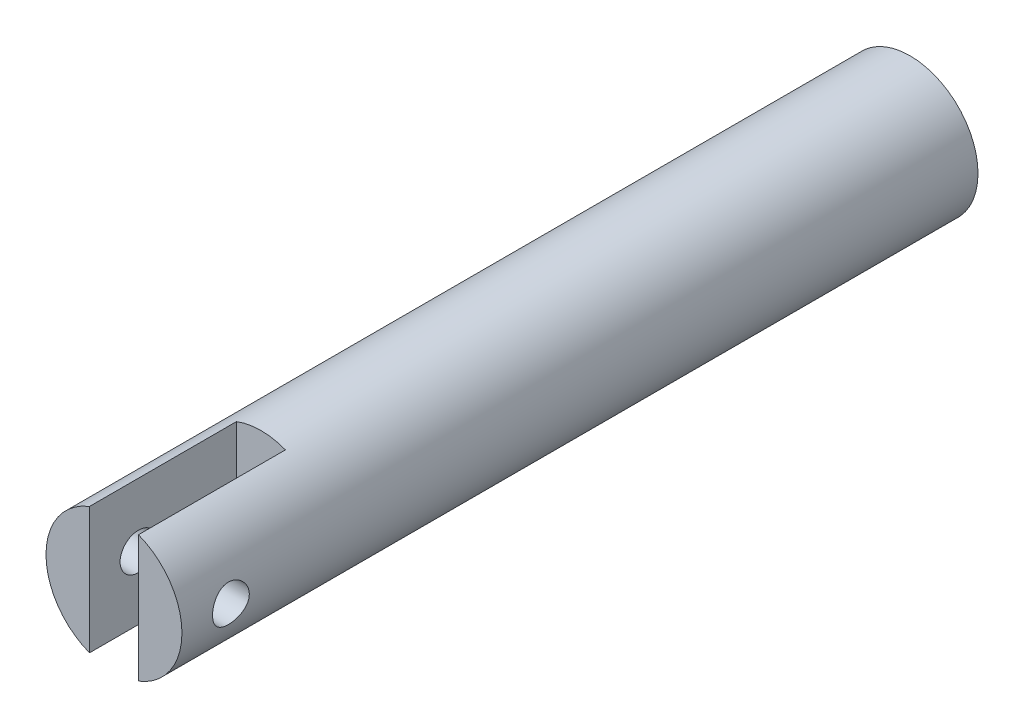
ISO-10303-21;
HEADER;
FILE_DESCRIPTION(('STEP AP214'),'2;1');
FILE_NAME('part.step','',(''),(''),'','','');
FILE_SCHEMA(('AUTOMOTIVE_DESIGN { 1 0 10303 214 1 1 1 1 }'));
ENDSEC;
DATA;
#1=APPLICATION_CONTEXT('core data for automotive mechanical design processes');
#2=APPLICATION_PROTOCOL_DEFINITION('international standard','automotive_design',2000,#1);
#3=PRODUCT_CONTEXT('',#1,'mechanical');
#4=PRODUCT('Part','Part','',(#3));
#5=PRODUCT_RELATED_PRODUCT_CATEGORY('part','',(#4));
#6=PRODUCT_DEFINITION_FORMATION('','',#4);
#7=PRODUCT_DEFINITION_CONTEXT('part definition',#1,'design');
#8=PRODUCT_DEFINITION('design','',#6,#7);
#9=PRODUCT_DEFINITION_SHAPE('','',#8);
#10=(LENGTH_UNIT() NAMED_UNIT(*) SI_UNIT(.MILLI.,.METRE.));
#11=(NAMED_UNIT(*) PLANE_ANGLE_UNIT() SI_UNIT($,.RADIAN.));
#12=(NAMED_UNIT(*) SI_UNIT($,.STERADIAN.) SOLID_ANGLE_UNIT());
#13=UNCERTAINTY_MEASURE_WITH_UNIT(LENGTH_MEASURE(1.E-05),#10,'distance_accuracy_value','');
#14=(GEOMETRIC_REPRESENTATION_CONTEXT(3) GLOBAL_UNCERTAINTY_ASSIGNED_CONTEXT((#13)) GLOBAL_UNIT_ASSIGNED_CONTEXT((#10,
#11,#12)) REPRESENTATION_CONTEXT('',''));
#15=CARTESIAN_POINT('',(0.,0.,0.));
#16=DIRECTION('',(0.,0.,1.));
#17=DIRECTION('',(1.,0.,0.));
#18=AXIS2_PLACEMENT_3D('',#15,#16,#17);
#19=CARTESIAN_POINT('',(0.,0.,65.));
#20=DIRECTION('',(0.,0.,1.));
#21=DIRECTION('',(1.,0.,0.));
#22=AXIS2_PLACEMENT_3D('',#19,#20,#21);
#23=PLANE('',#22);
#24=DIRECTION('',(0.,-1.,0.));
#25=VECTOR('',#24,1.);
#26=CARTESIAN_POINT('',(-2.,5.17711309515255,65.));
#27=LINE('',#26,#25);
#28=CARTESIAN_POINT('',(-2.,5.17711309515255,65.));
#29=VERTEX_POINT('',#28);
#30=CARTESIAN_POINT('',(-2.,-5.17711309515255,65.));
#31=VERTEX_POINT('',#30);
#32=EDGE_CURVE('E74',#29,#31,#27,.T.);
#33=ORIENTED_EDGE('',*,*,#32,.F.);
#34=CARTESIAN_POINT('',(0.,0.,65.));
#35=DIRECTION('',(0.,0.,1.));
#36=DIRECTION('',(1.,0.,0.));
#37=AXIS2_PLACEMENT_3D('',#34,#35,#36);
#38=CIRCLE('',#37,5.55);
#39=EDGE_CURVE('E11',#29,#31,#38,.T.);
#40=ORIENTED_EDGE('',*,*,#39,.T.);
#41=EDGE_LOOP('',(#33,#40));
#42=FACE_BOUND('',#41,.T.);
#43=ADVANCED_FACE('F33',(#42),#23,.T.);
#44=CARTESIAN_POINT('',(0.,0.,65.));
#45=DIRECTION('',(0.,0.,-1.));
#46=DIRECTION('',(-1.,0.,0.));
#47=AXIS2_PLACEMENT_3D('',#44,#45,#46);
#48=CYLINDRICAL_SURFACE('',#47,5.55);
#49=CARTESIAN_POINT('',(-5.55,0.,59.5));
#50=CARTESIAN_POINT('',(-5.54999879615194,0.0826494633927154,59.5000018746962));
#51=CARTESIAN_POINT('',(-5.54813568532362,0.165318848419868,59.506853812904));
#52=CARTESIAN_POINT('',(-5.54088440898738,0.328273451632411,59.5340303315248));
#53=CARTESIAN_POINT('',(-5.53549461428784,0.408557549979276,59.5543611387117));
#54=CARTESIAN_POINT('',(-5.52178442124985,0.564366049193908,59.6077840939381));
#55=CARTESIAN_POINT('',(-5.51346785987332,0.639896529910036,59.6408595392463));
#56=CARTESIAN_POINT('',(-5.49478153503013,0.784338444058895,59.7187702709216));
#57=CARTESIAN_POINT('',(-5.48441162002809,0.85324938841894,59.7636064252962));
#58=CARTESIAN_POINT('',(-5.46246127093075,0.984133559937081,59.8648904757167));
#59=CARTESIAN_POINT('',(-5.45085970647635,1.04592709324454,59.9215660045104));
#60=CARTESIAN_POINT('',(-5.42788828388297,1.15925819722945,60.0444335444044));
#61=CARTESIAN_POINT('',(-5.41651845661983,1.21079440917286,60.1106268142728));
#62=CARTESIAN_POINT('',(-5.39508096210617,1.30303115342026,60.2520939917978));
#63=CARTESIAN_POINT('',(-5.38503991518082,1.34352367385294,60.3275079287304));
#64=CARTESIAN_POINT('',(-5.36770808081144,1.41118330571831,60.4843887684982));
#65=CARTESIAN_POINT('',(-5.36041677093315,1.43835294871614,60.5658545179994));
#66=CARTESIAN_POINT('',(-5.34962833164668,1.47796903905552,60.7305333611906));
#67=CARTESIAN_POINT('',(-5.34604724875154,1.49074186800391,60.8136623033563));
#68=CARTESIAN_POINT('',(-5.34283400169016,1.50221948422755,60.9809542865722));
#69=CARTESIAN_POINT('',(-5.34320107787369,1.50092697775977,61.0651171255816));
#70=CARTESIAN_POINT('',(-5.34776761089798,1.48456944039451,61.2295297086572));
#71=CARTESIAN_POINT('',(-5.35185678021551,1.46990073062952,61.3098224354498));
#72=CARTESIAN_POINT('',(-5.36322997341351,1.42784250780183,61.4667624758096));
#73=CARTESIAN_POINT('',(-5.37051425881699,1.40045195343429,61.5434094904027));
#74=CARTESIAN_POINT('',(-5.38755296870838,1.3334078704218,61.6919088355209));
#75=CARTESIAN_POINT('',(-5.39733492625185,1.29361648626527,61.7636956347143));
#76=CARTESIAN_POINT('',(-5.41825216289466,1.20299640255253,61.8997117370747));
#77=CARTESIAN_POINT('',(-5.429387714712,1.1521654771554,61.9639395121253));
#78=CARTESIAN_POINT('',(-5.45221531507438,1.03888875462571,62.0852771073868));
#79=CARTESIAN_POINT('',(-5.46391350077369,0.976110532435758,62.1420758788547));
#80=CARTESIAN_POINT('',(-5.48621371709655,0.841776678813462,62.2444039738118));
#81=CARTESIAN_POINT('',(-5.49681570215022,0.770220682752514,62.2899328289116));
#82=CARTESIAN_POINT('',(-5.51579714245651,0.619872258080171,62.3685708376427));
#83=CARTESIAN_POINT('',(-5.5241662411197,0.541048315268525,62.4016224029782));
#84=CARTESIAN_POINT('',(-5.53766413798729,0.37868461864081,62.4539145573887));
#85=CARTESIAN_POINT('',(-5.54279366413402,0.295145928842746,62.4731582492697));
#86=CARTESIAN_POINT('',(-5.54912384681125,0.128377573772656,62.4967970008638));
#87=CARTESIAN_POINT('',(-5.5504363277452,0.0452119855218677,62.5016148108581));
#88=CARTESIAN_POINT('',(-5.54930671534324,-0.120739317200337,62.4974343088602));
#89=CARTESIAN_POINT('',(-5.54686502145572,-0.203525071146549,62.4884374667625));
#90=CARTESIAN_POINT('',(-5.53857375333191,-0.364848942531915,62.4572293591669));
#91=CARTESIAN_POINT('',(-5.53278532499192,-0.443436330325438,62.435255045592));
#92=CARTESIAN_POINT('',(-5.51845832017505,-0.595800840535774,62.378991941288));
#93=CARTESIAN_POINT('',(-5.50991944162924,-0.669577433535165,62.3447017979219));
#94=CARTESIAN_POINT('',(-5.49077807060945,-0.811859862642032,62.2640040455767));
#95=CARTESIAN_POINT('',(-5.48013775012766,-0.880230910060631,62.2173679825496));
#96=CARTESIAN_POINT('',(-5.45802286326308,-1.00832472838278,62.1135883880366));
#97=CARTESIAN_POINT('',(-5.44654812774349,-1.06804573853389,62.0564427226339));
#98=CARTESIAN_POINT('',(-5.42364433808291,-1.17893417351261,61.9312913887765));
#99=CARTESIAN_POINT('',(-5.41222627781712,-1.22980300036862,61.8630186397425));
#100=CARTESIAN_POINT('',(-5.39109349586186,-1.31936978116537,61.7186634174368));
#101=CARTESIAN_POINT('',(-5.38137870475979,-1.35806823113139,61.6425812626188));
#102=CARTESIAN_POINT('',(-5.3648647316121,-1.42190514266968,61.4851369239655));
#103=CARTESIAN_POINT('',(-5.35804890811988,-1.44712122035433,61.4038080506478));
#104=CARTESIAN_POINT('',(-5.34810458208024,-1.48345508406507,61.2378480302932));
#105=CARTESIAN_POINT('',(-5.34497510580962,-1.49457659313316,61.1532177614018));
#106=CARTESIAN_POINT('',(-5.34284070068284,-1.50218723372163,60.9861187129008));
#107=CARTESIAN_POINT('',(-5.3437003024775,-1.49915693877548,60.9036732285872));
#108=CARTESIAN_POINT('',(-5.34912914015623,-1.47966808775349,60.7405157803563));
#109=CARTESIAN_POINT('',(-5.35369827560105,-1.463209895251,60.6598037695642));
#110=CARTESIAN_POINT('',(-5.36594961229916,-1.4176145187469,60.5030277270834));
#111=CARTESIAN_POINT('',(-5.37360613355019,-1.38858178212087,60.426931170208));
#112=CARTESIAN_POINT('',(-5.39116955463475,-1.3187424295426,60.2806309729558));
#113=CARTESIAN_POINT('',(-5.40107681611949,-1.27793392116245,60.2104282820968));
#114=CARTESIAN_POINT('',(-5.42239869846201,-1.18425604648313,60.0756211641228));
#115=CARTESIAN_POINT('',(-5.43384977433815,-1.13105999285312,60.0112494924036));
#116=CARTESIAN_POINT('',(-5.45676839722498,-1.01473492702236,59.8921904291386));
#117=CARTESIAN_POINT('',(-5.46823594757932,-0.951603488480783,59.8375054101423));
#118=CARTESIAN_POINT('',(-5.49019935014915,-0.815512191776865,59.7381791110337));
#119=CARTESIAN_POINT('',(-5.5006680449896,-0.742365569701441,59.6937871970298));
#120=CARTESIAN_POINT('',(-5.51915451258881,-0.589366695549458,59.6179997935478));
#121=CARTESIAN_POINT('',(-5.52717381491222,-0.509518668160427,59.5865961889431));
#122=CARTESIAN_POINT('',(-5.53885482984226,-0.358337261031642,59.5416438492013));
#123=CARTESIAN_POINT('',(-5.54300340741267,-0.287638783374459,59.5260642669616));
#124=CARTESIAN_POINT('',(-5.54857637665883,-0.144631842519288,59.5052420630478));
#125=CARTESIAN_POINT('',(-5.55000105344379,-0.0723235486214627,59.4999983595213));
#126=CARTESIAN_POINT('',(-5.55,0.,59.5));
#127=B_SPLINE_CURVE_WITH_KNOTS('',3,(#49,#50,#51,#52,#53,#54,#55,#56,#57,#58,#59,#60,#61,#62,
#63,#64,#65,#66,#67,#68,#69,#70,#71,#72,#73,#74,#75,#76,#77,#78,#79,#80,#81,#82,#83,#84,#85,#86,
#87,#88,#89,#90,#91,#92,#93,#94,#95,#96,#97,#98,#99,#100,#101,#102,#103,#104,#105,#106,#107,
#108,#109,#110,#111,#112,#113,#114,#115,#116,#117,#118,#119,#120,#121,#122,#123,#124,#125,#126),
.UNSPECIFIED.,.T.,.F.,(4,2,2,2,2,2,2,2,2,2,2,2,2,2,2,2,2,2,2,2,2,2,2,2,2,2,2,2,2,2,2,2,2,2,2,2,
2,2,4),(0.,0.247683117479802,0.495480735843709,0.742954696811896,0.990446927913596,
1.24322718642299,1.49604090716615,1.75333091968523,2.01057202392053,2.26185607755089,
2.51309178343998,2.75711729570227,3.0011627853929,3.24802431731499,3.49493566883073,
3.75012973834969,4.00533441221877,4.26170297346541,4.51801390735887,4.76673633023641,
5.01543229060086,5.25972195861126,5.50403846495144,5.75323722720833,6.00248664387578,
6.25897090131834,6.51544470393504,6.77042567663096,7.02533928274809,7.27166059273816,
7.51797523356144,7.76228202195334,8.0066280936063,8.2583449745939,8.51012342354435,
8.76748013023476,9.02467579604023,9.24143700090325,9.45817551624786),.UNSPECIFIED.);
#128=CARTESIAN_POINT('',(-5.55,0.,59.5));
#129=VERTEX_POINT('',#128);
#130=EDGE_CURVE('E105',#129,#129,#127,.T.);
#131=ORIENTED_EDGE('',*,*,#130,.T.);
#132=EDGE_LOOP('',(#131));
#133=FACE_BOUND('',#132,.T.);
#134=CARTESIAN_POINT('',(5.55,0.,59.5));
#135=CARTESIAN_POINT('',(5.54999879615194,-0.0826494633927154,59.5000018746962));
#136=CARTESIAN_POINT('',(5.54813568532362,-0.165318848419868,59.506853812904));
#137=CARTESIAN_POINT('',(5.54088440898738,-0.328273451632411,59.5340303315248));
#138=CARTESIAN_POINT('',(5.53549461428784,-0.408557549979276,59.5543611387117));
#139=CARTESIAN_POINT('',(5.52178442124985,-0.564366049193908,59.6077840939381));
#140=CARTESIAN_POINT('',(5.51346785987332,-0.639896529910036,59.6408595392463));
#141=CARTESIAN_POINT('',(5.49478153503013,-0.784338444058895,59.7187702709216));
#142=CARTESIAN_POINT('',(5.48441162002809,-0.85324938841894,59.7636064252962));
#143=CARTESIAN_POINT('',(5.46246127093075,-0.984133559937081,59.8648904757167));
#144=CARTESIAN_POINT('',(5.45085970647635,-1.04592709324454,59.9215660045104));
#145=CARTESIAN_POINT('',(5.42788828388297,-1.15925819722945,60.0444335444044));
#146=CARTESIAN_POINT('',(5.41651845661983,-1.21079440917286,60.1106268142728));
#147=CARTESIAN_POINT('',(5.39508096210617,-1.30303115342026,60.2520939917978));
#148=CARTESIAN_POINT('',(5.38503991518082,-1.34352367385294,60.3275079287304));
#149=CARTESIAN_POINT('',(5.36770808081144,-1.41118330571831,60.4843887684982));
#150=CARTESIAN_POINT('',(5.36041677093315,-1.43835294871614,60.5658545179994));
#151=CARTESIAN_POINT('',(5.34962833164668,-1.47796903905552,60.7305333611906));
#152=CARTESIAN_POINT('',(5.34604724875154,-1.49074186800391,60.8136623033563));
#153=CARTESIAN_POINT('',(5.34283400169016,-1.50221948422755,60.9809542865722));
#154=CARTESIAN_POINT('',(5.34320107787369,-1.50092697775977,61.0651171255816));
#155=CARTESIAN_POINT('',(5.34776761089798,-1.48456944039451,61.2295297086572));
#156=CARTESIAN_POINT('',(5.35185678021551,-1.46990073062952,61.3098224354498));
#157=CARTESIAN_POINT('',(5.36322997341351,-1.42784250780183,61.4667624758096));
#158=CARTESIAN_POINT('',(5.37051425881699,-1.40045195343429,61.5434094904027));
#159=CARTESIAN_POINT('',(5.38755296870838,-1.3334078704218,61.6919088355209));
#160=CARTESIAN_POINT('',(5.39733492625185,-1.29361648626527,61.7636956347143));
#161=CARTESIAN_POINT('',(5.41825216289466,-1.20299640255253,61.8997117370747));
#162=CARTESIAN_POINT('',(5.429387714712,-1.1521654771554,61.9639395121253));
#163=CARTESIAN_POINT('',(5.45221531507438,-1.03888875462571,62.0852771073868));
#164=CARTESIAN_POINT('',(5.46391350077369,-0.976110532435758,62.1420758788547));
#165=CARTESIAN_POINT('',(5.48621371709655,-0.841776678813462,62.2444039738118));
#166=CARTESIAN_POINT('',(5.49681570215022,-0.770220682752514,62.2899328289116));
#167=CARTESIAN_POINT('',(5.51579714245651,-0.619872258080171,62.3685708376427));
#168=CARTESIAN_POINT('',(5.5241662411197,-0.541048315268525,62.4016224029782));
#169=CARTESIAN_POINT('',(5.53766413798729,-0.37868461864081,62.4539145573887));
#170=CARTESIAN_POINT('',(5.54279366413402,-0.295145928842746,62.4731582492697));
#171=CARTESIAN_POINT('',(5.54912384681125,-0.128377573772656,62.4967970008638));
#172=CARTESIAN_POINT('',(5.5504363277452,-0.0452119855218677,62.5016148108581));
#173=CARTESIAN_POINT('',(5.54930671534324,0.120739317200337,62.4974343088602));
#174=CARTESIAN_POINT('',(5.54686502145572,0.203525071146549,62.4884374667625));
#175=CARTESIAN_POINT('',(5.53857375333191,0.364848942531915,62.4572293591669));
#176=CARTESIAN_POINT('',(5.53278532499192,0.443436330325438,62.435255045592));
#177=CARTESIAN_POINT('',(5.51845832017505,0.595800840535774,62.378991941288));
#178=CARTESIAN_POINT('',(5.50991944162924,0.669577433535165,62.3447017979219));
#179=CARTESIAN_POINT('',(5.49077807060945,0.811859862642032,62.2640040455767));
#180=CARTESIAN_POINT('',(5.48013775012766,0.880230910060631,62.2173679825496));
#181=CARTESIAN_POINT('',(5.45802286326308,1.00832472838278,62.1135883880366));
#182=CARTESIAN_POINT('',(5.44654812774349,1.06804573853389,62.0564427226339));
#183=CARTESIAN_POINT('',(5.42364433808291,1.17893417351261,61.9312913887765));
#184=CARTESIAN_POINT('',(5.41222627781712,1.22980300036862,61.8630186397425));
#185=CARTESIAN_POINT('',(5.39109349586186,1.31936978116537,61.7186634174368));
#186=CARTESIAN_POINT('',(5.38137870475979,1.35806823113139,61.6425812626188));
#187=CARTESIAN_POINT('',(5.3648647316121,1.42190514266968,61.4851369239655));
#188=CARTESIAN_POINT('',(5.35804890811988,1.44712122035433,61.4038080506478));
#189=CARTESIAN_POINT('',(5.34810458208024,1.48345508406507,61.2378480302932));
#190=CARTESIAN_POINT('',(5.34497510580962,1.49457659313316,61.1532177614018));
#191=CARTESIAN_POINT('',(5.34284070068284,1.50218723372163,60.9861187129008));
#192=CARTESIAN_POINT('',(5.3437003024775,1.49915693877548,60.9036732285872));
#193=CARTESIAN_POINT('',(5.34912914015623,1.47966808775349,60.7405157803563));
#194=CARTESIAN_POINT('',(5.35369827560105,1.463209895251,60.6598037695642));
#195=CARTESIAN_POINT('',(5.36594961229916,1.4176145187469,60.5030277270834));
#196=CARTESIAN_POINT('',(5.37360613355019,1.38858178212087,60.426931170208));
#197=CARTESIAN_POINT('',(5.39116955463475,1.3187424295426,60.2806309729558));
#198=CARTESIAN_POINT('',(5.40107681611949,1.27793392116245,60.2104282820968));
#199=CARTESIAN_POINT('',(5.42239869846201,1.18425604648313,60.0756211641228));
#200=CARTESIAN_POINT('',(5.43384977433815,1.13105999285312,60.0112494924036));
#201=CARTESIAN_POINT('',(5.45676839722498,1.01473492702236,59.8921904291386));
#202=CARTESIAN_POINT('',(5.46823594757932,0.951603488480783,59.8375054101423));
#203=CARTESIAN_POINT('',(5.49019935014915,0.815512191776865,59.7381791110337));
#204=CARTESIAN_POINT('',(5.5006680449896,0.742365569701441,59.6937871970298));
#205=CARTESIAN_POINT('',(5.51915451258881,0.589366695549458,59.6179997935478));
#206=CARTESIAN_POINT('',(5.52717381491222,0.509518668160427,59.5865961889431));
#207=CARTESIAN_POINT('',(5.53885482984226,0.358337261031642,59.5416438492013));
#208=CARTESIAN_POINT('',(5.54300340741267,0.287638783374459,59.5260642669616));
#209=CARTESIAN_POINT('',(5.54857637665883,0.144631842519288,59.5052420630478));
#210=CARTESIAN_POINT('',(5.55000105344379,0.0723235486214627,59.4999983595213));
#211=CARTESIAN_POINT('',(5.55,0.,59.5));
#212=B_SPLINE_CURVE_WITH_KNOTS('',3,(#134,#135,#136,#137,#138,#139,#140,#141,#142,#143,#144,
#145,#146,#147,#148,#149,#150,#151,#152,#153,#154,#155,#156,#157,#158,#159,#160,#161,#162,#163,
#164,#165,#166,#167,#168,#169,#170,#171,#172,#173,#174,#175,#176,#177,#178,#179,#180,#181,#182,
#183,#184,#185,#186,#187,#188,#189,#190,#191,#192,#193,#194,#195,#196,#197,#198,#199,#200,#201,
#202,#203,#204,#205,#206,#207,#208,#209,#210,#211),.UNSPECIFIED.,.T.,.F.,(4,2,2,2,2,2,2,2,2,2,2,
2,2,2,2,2,2,2,2,2,2,2,2,2,2,2,2,2,2,2,2,2,2,2,2,2,2,2,4),(0.,0.247683117479802,
0.495480735843709,0.742954696811896,0.990446927913596,1.24322718642299,1.49604090716615,
1.75333091968523,2.01057202392053,2.26185607755089,2.51309178343998,2.75711729570227,
3.0011627853929,3.24802431731499,3.49493566883073,3.75012973834969,4.00533441221877,
4.26170297346541,4.51801390735887,4.76673633023641,5.01543229060086,5.25972195861126,
5.50403846495144,5.75323722720833,6.00248664387578,6.25897090131834,6.51544470393504,
6.77042567663096,7.02533928274809,7.27166059273816,7.51797523356144,7.76228202195334,
8.0066280936063,8.2583449745939,8.51012342354435,8.76748013023476,9.02467579604023,
9.24143700090325,9.45817551624786),.UNSPECIFIED.);
#213=CARTESIAN_POINT('',(5.55,0.,59.5));
#214=VERTEX_POINT('',#213);
#215=EDGE_CURVE('E144',#214,#214,#212,.T.);
#216=ORIENTED_EDGE('',*,*,#215,.T.);
#217=EDGE_LOOP('',(#216));
#218=FACE_BOUND('',#217,.T.);
#219=ORIENTED_EDGE('',*,*,#39,.F.);
#220=DIRECTION('',(0.,0.,1.));
#221=VECTOR('',#220,1.);
#222=CARTESIAN_POINT('',(-2.,5.17711309515255,53.));
#223=LINE('',#222,#221);
#224=CARTESIAN_POINT('',(-2.,5.17711309515255,53.));
#225=VERTEX_POINT('',#224);
#226=EDGE_CURVE('E88',#225,#29,#223,.T.);
#227=ORIENTED_EDGE('',*,*,#226,.F.);
#228=CARTESIAN_POINT('',(0.,0.,53.));
#229=DIRECTION('',(0.,0.,1.));
#230=DIRECTION('',(1.,0.,0.));
#231=AXIS2_PLACEMENT_3D('',#228,#229,#230);
#232=CIRCLE('',#231,5.55);
#233=CARTESIAN_POINT('',(2.,5.17711309515255,53.));
#234=VERTEX_POINT('',#233);
#235=EDGE_CURVE('E92',#234,#225,#232,.T.);
#236=ORIENTED_EDGE('',*,*,#235,.F.);
#237=DIRECTION('',(0.,0.,1.));
#238=VECTOR('',#237,1.);
#239=CARTESIAN_POINT('',(2.,5.17711309515255,53.));
#240=LINE('',#239,#238);
#241=CARTESIAN_POINT('',(2.,5.17711309515255,65.));
#242=VERTEX_POINT('',#241);
#243=EDGE_CURVE('E81',#234,#242,#240,.T.);
#244=ORIENTED_EDGE('',*,*,#243,.T.);
#245=CARTESIAN_POINT('',(2.,-5.17711309515255,65.));
#246=VERTEX_POINT('',#245);
#247=EDGE_CURVE('E43',#246,#242,#38,.T.);
#248=ORIENTED_EDGE('',*,*,#247,.F.);
#249=DIRECTION('',(0.,0.,1.));
#250=VECTOR('',#249,1.);
#251=CARTESIAN_POINT('',(2.,-5.17711309515255,53.));
#252=LINE('',#251,#250);
#253=CARTESIAN_POINT('',(2.,-5.17711309515255,53.));
#254=VERTEX_POINT('',#253);
#255=EDGE_CURVE('E51',#254,#246,#252,.T.);
#256=ORIENTED_EDGE('',*,*,#255,.F.);
#257=CARTESIAN_POINT('',(0.,0.,53.));
#258=DIRECTION('',(0.,0.,1.));
#259=DIRECTION('',(1.,0.,0.));
#260=AXIS2_PLACEMENT_3D('',#257,#258,#259);
#261=CIRCLE('',#260,5.55);
#262=CARTESIAN_POINT('',(-2.,-5.17711309515255,53.));
#263=VERTEX_POINT('',#262);
#264=EDGE_CURVE('E94',#263,#254,#261,.T.);
#265=ORIENTED_EDGE('',*,*,#264,.F.);
#266=DIRECTION('',(0.,0.,1.));
#267=VECTOR('',#266,1.);
#268=CARTESIAN_POINT('',(-2.,-5.17711309515255,53.));
#269=LINE('',#268,#267);
#270=EDGE_CURVE('E60',#263,#31,#269,.T.);
#271=ORIENTED_EDGE('',*,*,#270,.T.);
#272=EDGE_LOOP('',(#219,#227,#236,#244,#248,#256,#265,#271));
#273=FACE_BOUND('',#272,.T.);
#274=CARTESIAN_POINT('',(0.,0.,0.));
#275=DIRECTION('',(0.,0.,1.));
#276=DIRECTION('',(1.,0.,0.));
#277=AXIS2_PLACEMENT_3D('',#274,#275,#276);
#278=CIRCLE('',#277,5.55);
#279=CARTESIAN_POINT('',(5.55,0.,0.));
#280=VERTEX_POINT('',#279);
#281=EDGE_CURVE('E108',#280,#280,#278,.T.);
#282=ORIENTED_EDGE('',*,*,#281,.T.);
#283=EDGE_LOOP('',(#282));
#284=FACE_BOUND('',#283,.T.);
#285=ADVANCED_FACE('F35',(#133,#218,#273,#284),#48,.T.);
#286=DIRECTION('',(0.,1.,0.));
#287=VECTOR('',#286,1.);
#288=CARTESIAN_POINT('',(2.,5.17711309515255,65.));
#289=LINE('',#288,#287);
#290=EDGE_CURVE('E83',#246,#242,#289,.T.);
#291=ORIENTED_EDGE('',*,*,#290,.F.);
#292=ORIENTED_EDGE('',*,*,#247,.T.);
#293=EDGE_LOOP('',(#291,#292));
#294=FACE_BOUND('',#293,.T.);
#295=ADVANCED_FACE('F116',(#294),#23,.T.);
#296=CARTESIAN_POINT('',(0.,0.,0.));
#297=DIRECTION('',(0.,0.,1.));
#298=DIRECTION('',(1.,0.,0.));
#299=AXIS2_PLACEMENT_3D('',#296,#297,#298);
#300=PLANE('',#299);
#301=ORIENTED_EDGE('',*,*,#281,.F.);
#302=EDGE_LOOP('',(#301));
#303=FACE_BOUND('',#302,.T.);
#304=ADVANCED_FACE('F113',(#303),#300,.F.);
#305=CARTESIAN_POINT('',(-2.,5.17711309515255,53.));
#306=DIRECTION('',(-1.,0.,0.));
#307=DIRECTION('',(0.,0.,1.));
#308=AXIS2_PLACEMENT_3D('',#305,#306,#307);
#309=PLANE('',#308);
#310=CARTESIAN_POINT('',(-2.,0.,61.));
#311=DIRECTION('',(-1.,0.,0.));
#312=DIRECTION('',(0.,0.,1.));
#313=AXIS2_PLACEMENT_3D('',#310,#311,#312);
#314=CIRCLE('',#313,1.5);
#315=CARTESIAN_POINT('',(-2.,0.,62.5));
#316=VERTEX_POINT('',#315);
#317=EDGE_CURVE('E154',#316,#316,#314,.T.);
#318=ORIENTED_EDGE('',*,*,#317,.T.);
#319=EDGE_LOOP('',(#318));
#320=FACE_BOUND('',#319,.T.);
#321=ORIENTED_EDGE('',*,*,#32,.T.);
#322=ORIENTED_EDGE('',*,*,#270,.F.);
#323=DIRECTION('',(0.,-1.,0.));
#324=VECTOR('',#323,1.);
#325=CARTESIAN_POINT('',(-2.,5.17711309515255,53.));
#326=LINE('',#325,#324);
#327=EDGE_CURVE('E99',#225,#263,#326,.T.);
#328=ORIENTED_EDGE('',*,*,#327,.F.);
#329=ORIENTED_EDGE('',*,*,#226,.T.);
#330=EDGE_LOOP('',(#321,#322,#328,#329));
#331=FACE_BOUND('',#330,.T.);
#332=ADVANCED_FACE('F115',(#320,#331),#309,.F.);
#333=CARTESIAN_POINT('',(2.,5.17711309515255,53.));
#334=DIRECTION('',(1.,0.,0.));
#335=DIRECTION('',(0.,0.,-1.));
#336=AXIS2_PLACEMENT_3D('',#333,#334,#335);
#337=PLANE('',#336);
#338=CARTESIAN_POINT('',(2.,0.,61.));
#339=DIRECTION('',(1.,0.,0.));
#340=DIRECTION('',(0.,0.,-1.));
#341=AXIS2_PLACEMENT_3D('',#338,#339,#340);
#342=CIRCLE('',#341,1.5);
#343=CARTESIAN_POINT('',(2.,0.,59.5));
#344=VERTEX_POINT('',#343);
#345=EDGE_CURVE('E38',#344,#344,#342,.T.);
#346=ORIENTED_EDGE('',*,*,#345,.T.);
#347=EDGE_LOOP('',(#346));
#348=FACE_BOUND('',#347,.T.);
#349=ORIENTED_EDGE('',*,*,#290,.T.);
#350=ORIENTED_EDGE('',*,*,#243,.F.);
#351=DIRECTION('',(0.,1.,0.));
#352=VECTOR('',#351,1.);
#353=CARTESIAN_POINT('',(2.,5.17711309515255,53.));
#354=LINE('',#353,#352);
#355=EDGE_CURVE('E78',#254,#234,#354,.T.);
#356=ORIENTED_EDGE('',*,*,#355,.F.);
#357=ORIENTED_EDGE('',*,*,#255,.T.);
#358=EDGE_LOOP('',(#349,#350,#356,#357));
#359=FACE_BOUND('',#358,.T.);
#360=ADVANCED_FACE('F82',(#348,#359),#337,.F.);
#361=CARTESIAN_POINT('',(0.,0.,53.));
#362=DIRECTION('',(0.,0.,1.));
#363=DIRECTION('',(1.,0.,0.));
#364=AXIS2_PLACEMENT_3D('',#361,#362,#363);
#365=PLANE('',#364);
#366=ORIENTED_EDGE('',*,*,#264,.T.);
#367=ORIENTED_EDGE('',*,*,#355,.T.);
#368=ORIENTED_EDGE('',*,*,#235,.T.);
#369=ORIENTED_EDGE('',*,*,#327,.T.);
#370=EDGE_LOOP('',(#366,#367,#368,#369));
#371=FACE_BOUND('',#370,.T.);
#372=ADVANCED_FACE('F91',(#371),#365,.T.);
#373=CARTESIAN_POINT('',(-5.55,0.,61.));
#374=DIRECTION('',(1.,0.,0.));
#375=DIRECTION('',(0.,0.,-1.));
#376=AXIS2_PLACEMENT_3D('',#373,#374,#375);
#377=CYLINDRICAL_SURFACE('',#376,1.5);
#378=ORIENTED_EDGE('',*,*,#345,.F.);
#379=EDGE_LOOP('',(#378));
#380=FACE_BOUND('',#379,.T.);
#381=ORIENTED_EDGE('',*,*,#215,.F.);
#382=EDGE_LOOP('',(#381));
#383=FACE_BOUND('',#382,.T.);
#384=ADVANCED_FACE('F137',(#380,#383),#377,.F.);
#385=ORIENTED_EDGE('',*,*,#317,.F.);
#386=EDGE_LOOP('',(#385));
#387=FACE_BOUND('',#386,.T.);
#388=ORIENTED_EDGE('',*,*,#130,.F.);
#389=EDGE_LOOP('',(#388));
#390=FACE_BOUND('',#389,.T.);
#391=ADVANCED_FACE('F138',(#387,#390),#377,.F.);
#392=CLOSED_SHELL('',(#43,#285,#295,#304,#332,#360,#372,#384,#391));
#393=MANIFOLD_SOLID_BREP('B2',#392);
#394=ADVANCED_BREP_SHAPE_REPRESENTATION('',(#18,#393),#14);
#395=SHAPE_DEFINITION_REPRESENTATION(#9,#394);
ENDSEC;
END-ISO-10303-21;
